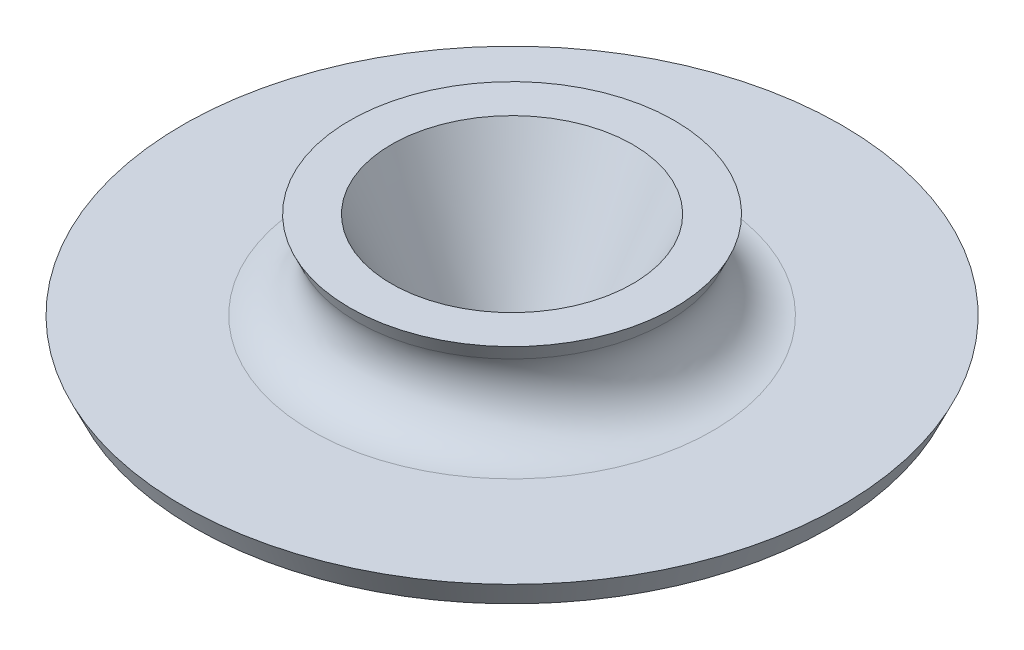
ISO-10303-21;
HEADER;
FILE_DESCRIPTION(('STEP AP214'),'2;1');
FILE_NAME('part.step','',(''),(''),'','','');
FILE_SCHEMA(('AUTOMOTIVE_DESIGN { 1 0 10303 214 1 1 1 1 }'));
ENDSEC;
DATA;
#1=APPLICATION_CONTEXT('core data for automotive mechanical design processes');
#2=APPLICATION_PROTOCOL_DEFINITION('international standard','automotive_design',2000,#1);
#3=PRODUCT_CONTEXT('',#1,'mechanical');
#4=PRODUCT('Part','Part','',(#3));
#5=PRODUCT_RELATED_PRODUCT_CATEGORY('part','',(#4));
#6=PRODUCT_DEFINITION_FORMATION('','',#4);
#7=PRODUCT_DEFINITION_CONTEXT('part definition',#1,'design');
#8=PRODUCT_DEFINITION('design','',#6,#7);
#9=PRODUCT_DEFINITION_SHAPE('','',#8);
#10=(LENGTH_UNIT() NAMED_UNIT(*) SI_UNIT(.MILLI.,.METRE.));
#11=(NAMED_UNIT(*) PLANE_ANGLE_UNIT() SI_UNIT($,.RADIAN.));
#12=(NAMED_UNIT(*) SI_UNIT($,.STERADIAN.) SOLID_ANGLE_UNIT());
#13=UNCERTAINTY_MEASURE_WITH_UNIT(LENGTH_MEASURE(1.E-05),#10,'distance_accuracy_value','');
#14=(GEOMETRIC_REPRESENTATION_CONTEXT(3) GLOBAL_UNCERTAINTY_ASSIGNED_CONTEXT((#13)) GLOBAL_UNIT_ASSIGNED_CONTEXT((#10,
#11,#12)) REPRESENTATION_CONTEXT('',''));
#15=CARTESIAN_POINT('',(0.,0.,0.));
#16=DIRECTION('',(0.,0.,1.));
#17=DIRECTION('',(1.,0.,0.));
#18=AXIS2_PLACEMENT_3D('',#15,#16,#17);
#19=CARTESIAN_POINT('',(0.,0.,0.));
#20=DIRECTION('',(0.,1.,0.));
#21=DIRECTION('',(0.,0.,1.));
#22=AXIS2_PLACEMENT_3D('',#19,#20,#21);
#23=CONICAL_SURFACE('',#22,12.7,0.436332312998576);
#24=CARTESIAN_POINT('',(0.,38.1,0.));
#25=DIRECTION('',(0.,-1.,0.));
#26=DIRECTION('',(0.,0.,-1.));
#27=AXIS2_PLACEMENT_3D('',#24,#25,#26);
#28=CIRCLE('',#27,30.4663217757051);
#29=CARTESIAN_POINT('',(0.,38.1,-30.4663217757051));
#30=VERTEX_POINT('',#29);
#31=EDGE_CURVE('E83',#30,#30,#28,.T.);
#32=ORIENTED_EDGE('',*,*,#31,.F.);
#33=EDGE_LOOP('',(#32));
#34=FACE_BOUND('',#33,.T.);
#35=CARTESIAN_POINT('',(0.,0.,0.));
#36=DIRECTION('',(0.,-1.,0.));
#37=DIRECTION('',(0.,0.,-1.));
#38=AXIS2_PLACEMENT_3D('',#35,#36,#37);
#39=CIRCLE('',#38,12.7);
#40=CARTESIAN_POINT('',(0.,0.,-12.7));
#41=VERTEX_POINT('',#40);
#42=EDGE_CURVE('E56',#41,#41,#39,.T.);
#43=ORIENTED_EDGE('',*,*,#42,.T.);
#44=EDGE_LOOP('',(#43));
#45=FACE_BOUND('',#44,.T.);
#46=ADVANCED_FACE('F43',(#34,#45),#23,.F.);
#47=CARTESIAN_POINT('',(-12.7,0.,0.));
#48=DIRECTION('',(0.,1.,0.));
#49=DIRECTION('',(0.,0.,1.));
#50=AXIS2_PLACEMENT_3D('',#47,#48,#49);
#51=PLANE('',#50);
#52=ORIENTED_EDGE('',*,*,#42,.F.);
#53=EDGE_LOOP('',(#52));
#54=FACE_BOUND('',#53,.T.);
#55=CARTESIAN_POINT('',(0.,0.,0.));
#56=DIRECTION('',(0.,-1.,0.));
#57=DIRECTION('',(0.,0.,-1.));
#58=AXIS2_PLACEMENT_3D('',#55,#56,#57);
#59=CIRCLE('',#58,19.7064497854118);
#60=CARTESIAN_POINT('',(0.,0.,-19.7064497854118));
#61=VERTEX_POINT('',#60);
#62=EDGE_CURVE('E61',#61,#61,#59,.T.);
#63=ORIENTED_EDGE('',*,*,#62,.T.);
#64=EDGE_LOOP('',(#63));
#65=FACE_BOUND('',#64,.T.);
#66=ADVANCED_FACE('F92',(#54,#65),#51,.F.);
#67=CARTESIAN_POINT('',(0.,9.6287581699346,0.));
#68=DIRECTION('',(0.,1.,0.));
#69=DIRECTION('',(0.,0.,1.));
#70=AXIS2_PLACEMENT_3D('',#67,#68,#69);
#71=CONICAL_SURFACE('',#70,24.1964134585747,0.436332312998576);
#72=ORIENTED_EDGE('',*,*,#62,.F.);
#73=EDGE_LOOP('',(#72));
#74=FACE_BOUND('',#73,.T.);
#75=CARTESIAN_POINT('',(0.,9.6287581699346,0.));
#76=DIRECTION('',(0.,-1.,0.));
#77=DIRECTION('',(0.,0.,-1.));
#78=AXIS2_PLACEMENT_3D('',#75,#76,#77);
#79=CIRCLE('',#78,24.1964134585747);
#80=CARTESIAN_POINT('',(0.,9.6287581699346,-24.1964134585747));
#81=VERTEX_POINT('',#80);
#82=EDGE_CURVE('E67',#81,#81,#79,.T.);
#83=ORIENTED_EDGE('',*,*,#82,.T.);
#84=EDGE_LOOP('',(#83));
#85=FACE_BOUND('',#84,.T.);
#86=ADVANCED_FACE('F97',(#74,#85),#71,.T.);
#87=CARTESIAN_POINT('',(-24.1964134585747,9.6287581699346,0.));
#88=DIRECTION('',(0.,1.,0.));
#89=DIRECTION('',(0.,0.,1.));
#90=AXIS2_PLACEMENT_3D('',#87,#88,#89);
#91=PLANE('',#90);
#92=ORIENTED_EDGE('',*,*,#82,.F.);
#93=EDGE_LOOP('',(#92));
#94=FACE_BOUND('',#93,.T.);
#95=CARTESIAN_POINT('',(0.,9.62875816993459,0.));
#96=DIRECTION('',(0.,-1.,0.));
#97=DIRECTION('',(0.,0.,-1.));
#98=AXIS2_PLACEMENT_3D('',#95,#96,#97);
#99=CIRCLE('',#98,80.2480117418691);
#100=CARTESIAN_POINT('',(0.,9.62875816993459,-80.2480117418691));
#101=VERTEX_POINT('',#100);
#102=EDGE_CURVE('E71',#101,#101,#99,.T.);
#103=ORIENTED_EDGE('',*,*,#102,.T.);
#104=EDGE_LOOP('',(#103));
#105=FACE_BOUND('',#104,.T.);
#106=ADVANCED_FACE('F103',(#94,#105),#91,.F.);
#107=CARTESIAN_POINT('',(0.,15.9787581699346,0.));
#108=DIRECTION('',(0.,1.,0.));
#109=DIRECTION('',(0.,0.,1.));
#110=AXIS2_PLACEMENT_3D('',#107,#108,#109);
#111=CONICAL_SURFACE('',#110,83.2090653711533,0.436332312998577);
#112=ORIENTED_EDGE('',*,*,#102,.F.);
#113=EDGE_LOOP('',(#112));
#114=FACE_BOUND('',#113,.T.);
#115=CARTESIAN_POINT('',(0.,15.9787581699346,0.));
#116=DIRECTION('',(0.,-1.,0.));
#117=DIRECTION('',(0.,0.,-1.));
#118=AXIS2_PLACEMENT_3D('',#115,#116,#117);
#119=CIRCLE('',#118,83.2090653711533);
#120=CARTESIAN_POINT('',(0.,15.9787581699346,-83.2090653711533));
#121=VERTEX_POINT('',#120);
#122=EDGE_CURVE('E75',#121,#121,#119,.T.);
#123=ORIENTED_EDGE('',*,*,#122,.T.);
#124=EDGE_LOOP('',(#123));
#125=FACE_BOUND('',#124,.T.);
#126=ADVANCED_FACE('F109',(#114,#125),#111,.T.);
#127=CARTESIAN_POINT('',(-83.2090653711533,15.9787581699346,0.));
#128=DIRECTION('',(0.,-1.,0.));
#129=DIRECTION('',(0.,0.,-1.));
#130=AXIS2_PLACEMENT_3D('',#127,#128,#129);
#131=PLANE('',#130);
#132=CARTESIAN_POINT('',(0.,15.9787581699346,0.));
#133=DIRECTION('',(0.,-1.,0.));
#134=DIRECTION('',(0.,0.,-1.));
#135=AXIS2_PLACEMENT_3D('',#132,#133,#134);
#136=CIRCLE('',#135,50.5956988099568);
#137=CARTESIAN_POINT('',(0.,15.9787581699346,-50.5956988099568));
#138=VERTEX_POINT('',#137);
#139=EDGE_CURVE('E51',#138,#138,#136,.T.);
#140=ORIENTED_EDGE('',*,*,#139,.T.);
#141=EDGE_LOOP('',(#140));
#142=FACE_BOUND('',#141,.T.);
#143=ORIENTED_EDGE('',*,*,#122,.F.);
#144=EDGE_LOOP('',(#143));
#145=FACE_BOUND('',#144,.T.);
#146=ADVANCED_FACE('F115',(#142,#145),#131,.F.);
#147=CARTESIAN_POINT('',(0.,38.1,0.));
#148=DIRECTION('',(0.,1.,0.));
#149=DIRECTION('',(0.,0.,1.));
#150=AXIS2_PLACEMENT_3D('',#147,#148,#149);
#151=CONICAL_SURFACE('',#150,40.9759964538228,0.436332312998576);
#152=CARTESIAN_POINT('',(0.,34.0460100940414,0.));
#153=DIRECTION('',(0.,1.,0.));
#154=DIRECTION('',(0.,0.,1.));
#155=AXIS2_PLACEMENT_3D('',#152,#153,#154);
#156=CIRCLE('',#155,39.0855899145913);
#157=CARTESIAN_POINT('',(0.,34.0460100940414,39.0855899145913));
#158=VERTEX_POINT('',#157);
#159=EDGE_CURVE('E10',#158,#158,#156,.T.);
#160=ORIENTED_EDGE('',*,*,#159,.T.);
#161=EDGE_LOOP('',(#160));
#162=FACE_BOUND('',#161,.T.);
#163=CARTESIAN_POINT('',(0.,38.1,0.));
#164=DIRECTION('',(0.,-1.,0.));
#165=DIRECTION('',(0.,0.,-1.));
#166=AXIS2_PLACEMENT_3D('',#163,#164,#165);
#167=CIRCLE('',#166,40.9759964538228);
#168=CARTESIAN_POINT('',(0.,38.1,-40.9759964538228));
#169=VERTEX_POINT('',#168);
#170=EDGE_CURVE('E79',#169,#169,#167,.T.);
#171=ORIENTED_EDGE('',*,*,#170,.T.);
#172=EDGE_LOOP('',(#171));
#173=FACE_BOUND('',#172,.T.);
#174=ADVANCED_FACE('F120',(#162,#173),#151,.T.);
#175=CARTESIAN_POINT('',(-40.9759964538228,38.1,0.));
#176=DIRECTION('',(0.,-1.,0.));
#177=DIRECTION('',(0.,0.,-1.));
#178=AXIS2_PLACEMENT_3D('',#175,#176,#177);
#179=PLANE('',#178);
#180=ORIENTED_EDGE('',*,*,#170,.F.);
#181=EDGE_LOOP('',(#180));
#182=FACE_BOUND('',#181,.T.);
#183=ORIENTED_EDGE('',*,*,#31,.T.);
#184=EDGE_LOOP('',(#183));
#185=FACE_BOUND('',#184,.T.);
#186=ADVANCED_FACE('F88',(#182,#185),#179,.F.);
#187=CARTESIAN_POINT('',(0.,28.6787581699346,0.));
#188=DIRECTION('',(0.,-1.,0.));
#189=DIRECTION('',(0.,0.,-1.));
#190=AXIS2_PLACEMENT_3D('',#187,#188,#189);
#191=TOROIDAL_SURFACE('',#190,50.5956988099568,12.7);
#192=ORIENTED_EDGE('',*,*,#159,.F.);
#193=EDGE_LOOP('',(#192));
#194=FACE_BOUND('',#193,.T.);
#195=ORIENTED_EDGE('',*,*,#139,.F.);
#196=EDGE_LOOP('',(#195));
#197=FACE_BOUND('',#196,.T.);
#198=ADVANCED_FACE('F45',(#194,#197),#191,.F.);
#199=CLOSED_SHELL('',(#46,#66,#86,#106,#126,#146,#174,#186,#198));
#200=MANIFOLD_SOLID_BREP('B2',#199);
#201=ADVANCED_BREP_SHAPE_REPRESENTATION('',(#18,#200),#14);
#202=SHAPE_DEFINITION_REPRESENTATION(#9,#201);
ENDSEC;
END-ISO-10303-21;
